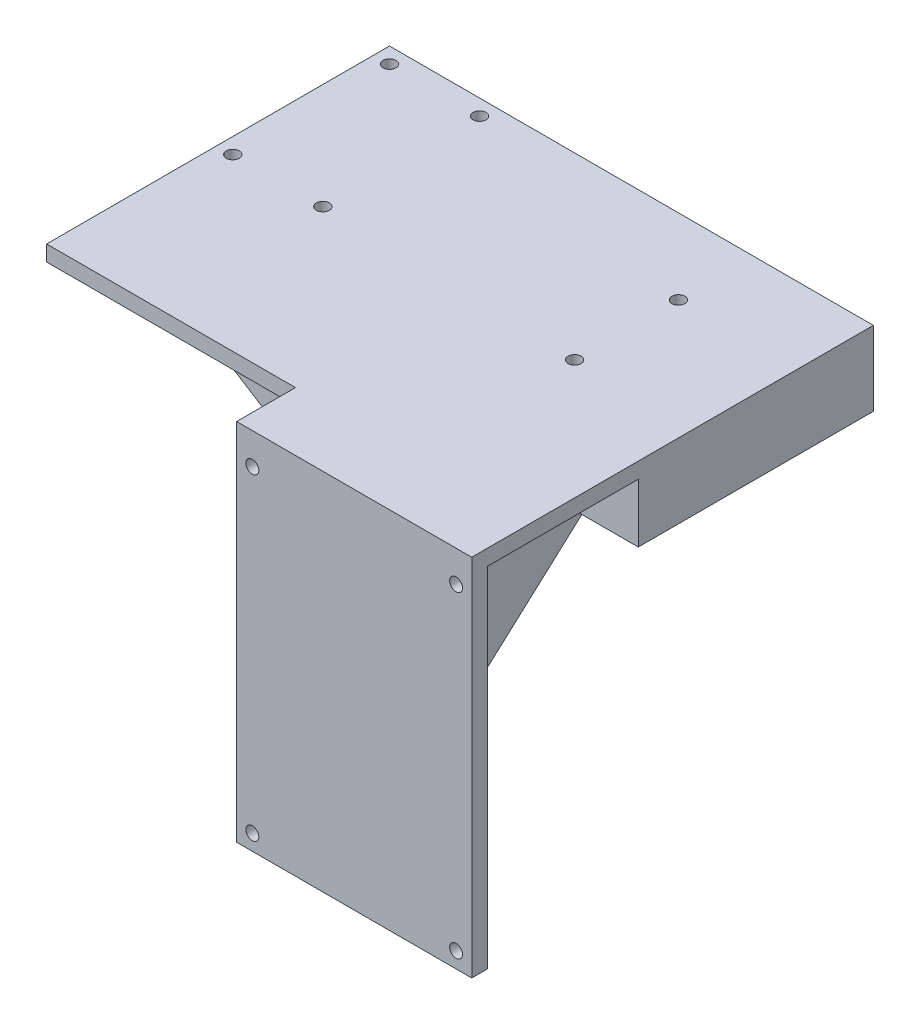
ISO-10303-21;
HEADER;
FILE_DESCRIPTION(('STEP AP214'),'2;1');
FILE_NAME('part.step','',(''),(''),'','','');
FILE_SCHEMA(('AUTOMOTIVE_DESIGN { 1 0 10303 214 1 1 1 1 }'));
ENDSEC;
DATA;
#1=APPLICATION_CONTEXT('core data for automotive mechanical design processes');
#2=APPLICATION_PROTOCOL_DEFINITION('international standard','automotive_design',2000,#1);
#3=PRODUCT_CONTEXT('',#1,'mechanical');
#4=PRODUCT('Part','Part','',(#3));
#5=PRODUCT_RELATED_PRODUCT_CATEGORY('part','',(#4));
#6=PRODUCT_DEFINITION_FORMATION('','',#4);
#7=PRODUCT_DEFINITION_CONTEXT('part definition',#1,'design');
#8=PRODUCT_DEFINITION('design','',#6,#7);
#9=PRODUCT_DEFINITION_SHAPE('','',#8);
#10=(LENGTH_UNIT() NAMED_UNIT(*) SI_UNIT(.MILLI.,.METRE.));
#11=(NAMED_UNIT(*) PLANE_ANGLE_UNIT() SI_UNIT($,.RADIAN.));
#12=(NAMED_UNIT(*) SI_UNIT($,.STERADIAN.) SOLID_ANGLE_UNIT());
#13=UNCERTAINTY_MEASURE_WITH_UNIT(LENGTH_MEASURE(1.E-05),#10,'distance_accuracy_value','');
#14=(GEOMETRIC_REPRESENTATION_CONTEXT(3) GLOBAL_UNCERTAINTY_ASSIGNED_CONTEXT((#13)) GLOBAL_UNIT_ASSIGNED_CONTEXT((#10,
#11,#12)) REPRESENTATION_CONTEXT('',''));
#15=CARTESIAN_POINT('',(0.,0.,0.));
#16=DIRECTION('',(0.,0.,1.));
#17=DIRECTION('',(1.,0.,0.));
#18=AXIS2_PLACEMENT_3D('',#15,#16,#17);
#19=CARTESIAN_POINT('',(60.,-4.,-15.));
#20=DIRECTION('',(0.,1.,0.));
#21=DIRECTION('',(0.,0.,1.));
#22=AXIS2_PLACEMENT_3D('',#19,#20,#21);
#23=PLANE('',#22);
#24=CARTESIAN_POINT('',(29.5,-4.,-83.25));
#25=DIRECTION('',(0.,1.,0.));
#26=DIRECTION('',(0.,0.,1.));
#27=AXIS2_PLACEMENT_3D('',#24,#25,#26);
#28=CIRCLE('',#27,1.65);
#29=CARTESIAN_POINT('',(29.5,-4.,-81.6));
#30=VERTEX_POINT('',#29);
#31=EDGE_CURVE('E244',#30,#30,#28,.T.);
#32=ORIENTED_EDGE('',*,*,#31,.T.);
#33=EDGE_LOOP('',(#32));
#34=FACE_BOUND('',#33,.T.);
#35=CARTESIAN_POINT('',(29.5,-4.,-56.75));
#36=DIRECTION('',(0.,1.,0.));
#37=DIRECTION('',(0.,0.,1.));
#38=AXIS2_PLACEMENT_3D('',#35,#36,#37);
#39=CIRCLE('',#38,1.65);
#40=CARTESIAN_POINT('',(29.5,-4.,-55.1));
#41=VERTEX_POINT('',#40);
#42=EDGE_CURVE('E36',#41,#41,#39,.T.);
#43=ORIENTED_EDGE('',*,*,#42,.T.);
#44=EDGE_LOOP('',(#43));
#45=FACE_BOUND('',#44,.T.);
#46=DIRECTION('',(-1.,0.,0.));
#47=VECTOR('',#46,1.);
#48=CARTESIAN_POINT('',(60.,-4.,-42.5));
#49=LINE('',#48,#47);
#50=CARTESIAN_POINT('',(60.,-4.,-42.5));
#51=VERTEX_POINT('',#50);
#52=CARTESIAN_POINT('',(35.,-4.,-42.5));
#53=VERTEX_POINT('',#52);
#54=EDGE_CURVE('E598',#51,#53,#49,.T.);
#55=ORIENTED_EDGE('',*,*,#54,.F.);
#56=DIRECTION('',(0.,0.,1.));
#57=VECTOR('',#56,1.);
#58=CARTESIAN_POINT('',(60.,-4.,-15.));
#59=LINE('',#58,#57);
#60=CARTESIAN_POINT('',(60.,-4.,-4.));
#61=VERTEX_POINT('',#60);
#62=EDGE_CURVE('E177',#51,#61,#59,.T.);
#63=ORIENTED_EDGE('',*,*,#62,.T.);
#64=DIRECTION('',(-1.,0.,0.));
#65=VECTOR('',#64,1.);
#66=CARTESIAN_POINT('',(60.,-4.,-4.));
#67=LINE('',#66,#65);
#68=CARTESIAN_POINT('',(25.,-4.,-4.));
#69=VERTEX_POINT('',#68);
#70=EDGE_CURVE('E285',#61,#69,#67,.T.);
#71=ORIENTED_EDGE('',*,*,#70,.T.);
#72=DIRECTION('',(0.,0.,1.));
#73=VECTOR('',#72,1.);
#74=CARTESIAN_POINT('',(25.,-4.,-4.));
#75=LINE('',#74,#73);
#76=CARTESIAN_POINT('',(25.,-4.,-102.5));
#77=VERTEX_POINT('',#76);
#78=EDGE_CURVE('E236',#77,#69,#75,.T.);
#79=ORIENTED_EDGE('',*,*,#78,.F.);
#80=DIRECTION('',(-1.,0.,0.));
#81=VECTOR('',#80,1.);
#82=CARTESIAN_POINT('',(60.,-4.,-102.5));
#83=LINE('',#82,#81);
#84=CARTESIAN_POINT('',(35.,-4.,-102.5));
#85=VERTEX_POINT('',#84);
#86=EDGE_CURVE('E264',#85,#77,#83,.T.);
#87=ORIENTED_EDGE('',*,*,#86,.F.);
#88=DIRECTION('',(0.,0.,-1.));
#89=VECTOR('',#88,1.);
#90=CARTESIAN_POINT('',(35.,-4.,-102.5));
#91=LINE('',#90,#89);
#92=EDGE_CURVE('E171',#53,#85,#91,.T.);
#93=ORIENTED_EDGE('',*,*,#92,.F.);
#94=EDGE_LOOP('',(#55,#63,#71,#79,#87,#93));
#95=FACE_BOUND('',#94,.T.);
#96=ADVANCED_FACE('F32',(#34,#45,#95),#23,.F.);
#97=CARTESIAN_POINT('',(-59.5,-4.,-98.5));
#98=DIRECTION('',(0.,1.,0.));
#99=DIRECTION('',(0.,0.,1.));
#100=AXIS2_PLACEMENT_3D('',#97,#98,#99);
#101=CIRCLE('',#100,1.65);
#102=CARTESIAN_POINT('',(-59.5,-4.,-96.85));
#103=VERTEX_POINT('',#102);
#104=EDGE_CURVE('E258',#103,#103,#101,.T.);
#105=ORIENTED_EDGE('',*,*,#104,.T.);
#106=EDGE_LOOP('',(#105));
#107=FACE_BOUND('',#106,.T.);
#108=CARTESIAN_POINT('',(-36.5,-4.,-58.5));
#109=DIRECTION('',(0.,1.,0.));
#110=DIRECTION('',(0.,0.,1.));
#111=AXIS2_PLACEMENT_3D('',#108,#109,#110);
#112=CIRCLE('',#111,1.65);
#113=CARTESIAN_POINT('',(-36.5,-4.,-56.85));
#114=VERTEX_POINT('',#113);
#115=EDGE_CURVE('E248',#114,#114,#112,.T.);
#116=ORIENTED_EDGE('',*,*,#115,.T.);
#117=EDGE_LOOP('',(#116));
#118=FACE_BOUND('',#117,.T.);
#119=CARTESIAN_POINT('',(-59.5,-4.,-58.5));
#120=DIRECTION('',(0.,1.,0.));
#121=DIRECTION('',(0.,0.,1.));
#122=AXIS2_PLACEMENT_3D('',#119,#120,#121);
#123=CIRCLE('',#122,1.65);
#124=CARTESIAN_POINT('',(-59.5,-4.,-56.85));
#125=VERTEX_POINT('',#124);
#126=EDGE_CURVE('E335',#125,#125,#123,.T.);
#127=ORIENTED_EDGE('',*,*,#126,.T.);
#128=EDGE_LOOP('',(#127));
#129=FACE_BOUND('',#128,.T.);
#130=CARTESIAN_POINT('',(-36.5,-4.,-98.5));
#131=DIRECTION('',(0.,1.,0.));
#132=DIRECTION('',(0.,0.,1.));
#133=AXIS2_PLACEMENT_3D('',#130,#131,#132);
#134=CIRCLE('',#133,1.65);
#135=CARTESIAN_POINT('',(-36.5,-4.,-96.85));
#136=VERTEX_POINT('',#135);
#137=EDGE_CURVE('E259',#136,#136,#134,.T.);
#138=ORIENTED_EDGE('',*,*,#137,.T.);
#139=EDGE_LOOP('',(#138));
#140=FACE_BOUND('',#139,.T.);
#141=DIRECTION('',(1.,0.,0.));
#142=VECTOR('',#141,1.);
#143=CARTESIAN_POINT('',(-63.5,-4.,-50.5));
#144=LINE('',#143,#142);
#145=CARTESIAN_POINT('',(-63.5,-4.,-50.5));
#146=VERTEX_POINT('',#145);
#147=CARTESIAN_POINT('',(8.00000000000001,-4.,-50.5));
#148=VERTEX_POINT('',#147);
#149=EDGE_CURVE('E188',#146,#148,#144,.T.);
#150=ORIENTED_EDGE('',*,*,#149,.F.);
#151=DIRECTION('',(0.,0.,1.));
#152=VECTOR('',#151,1.);
#153=CARTESIAN_POINT('',(-63.5,-4.,-102.5));
#154=LINE('',#153,#152);
#155=CARTESIAN_POINT('',(-63.5,-4.,-102.5));
#156=VERTEX_POINT('',#155);
#157=EDGE_CURVE('E282',#156,#146,#154,.T.);
#158=ORIENTED_EDGE('',*,*,#157,.F.);
#159=CARTESIAN_POINT('',(8.,-4.,-102.5));
#160=VERTEX_POINT('',#159);
#161=EDGE_CURVE('E262',#160,#156,#83,.T.);
#162=ORIENTED_EDGE('',*,*,#161,.F.);
#163=DIRECTION('',(0.,0.,-1.));
#164=VECTOR('',#163,1.);
#165=CARTESIAN_POINT('',(8.,-4.,-102.5));
#166=LINE('',#165,#164);
#167=EDGE_CURVE('E215',#148,#160,#166,.T.);
#168=ORIENTED_EDGE('',*,*,#167,.F.);
#169=EDGE_LOOP('',(#150,#158,#162,#168));
#170=FACE_BOUND('',#169,.T.);
#171=ADVANCED_FACE('F361',(#107,#118,#129,#140,#170),#23,.F.);
#172=DIRECTION('',(-1.,0.,0.));
#173=VECTOR('',#172,1.);
#174=CARTESIAN_POINT('',(-63.5,-4.,-33.5));
#175=LINE('',#174,#173);
#176=CARTESIAN_POINT('',(8.,-4.,-33.5));
#177=VERTEX_POINT('',#176);
#178=CARTESIAN_POINT('',(-63.5,-4.,-33.5));
#179=VERTEX_POINT('',#178);
#180=EDGE_CURVE('E192',#177,#179,#175,.T.);
#181=ORIENTED_EDGE('',*,*,#180,.F.);
#182=CARTESIAN_POINT('',(8.,-4.,-4.00000000000002));
#183=VERTEX_POINT('',#182);
#184=EDGE_CURVE('E217',#183,#177,#166,.T.);
#185=ORIENTED_EDGE('',*,*,#184,.F.);
#186=DIRECTION('',(-1.,0.,0.));
#187=VECTOR('',#186,1.);
#188=CARTESIAN_POINT('',(8.,-4.,-4.00000000000002));
#189=LINE('',#188,#187);
#190=CARTESIAN_POINT('',(0.,-4.,-4.00000000000002));
#191=VERTEX_POINT('',#190);
#192=EDGE_CURVE('E224',#183,#191,#189,.T.);
#193=ORIENTED_EDGE('',*,*,#192,.T.);
#194=DIRECTION('',(0.,0.,-1.));
#195=VECTOR('',#194,1.);
#196=CARTESIAN_POINT('',(0.,-4.,-102.5));
#197=LINE('',#196,#195);
#198=CARTESIAN_POINT('',(0.,-4.,-15.));
#199=VERTEX_POINT('',#198);
#200=EDGE_CURVE('E216',#191,#199,#197,.T.);
#201=ORIENTED_EDGE('',*,*,#200,.T.);
#202=DIRECTION('',(-1.,0.,0.));
#203=VECTOR('',#202,1.);
#204=CARTESIAN_POINT('',(60.,-4.,-15.));
#205=LINE('',#204,#203);
#206=CARTESIAN_POINT('',(-63.5,-4.,-15.));
#207=VERTEX_POINT('',#206);
#208=EDGE_CURVE('E272',#199,#207,#205,.T.);
#209=ORIENTED_EDGE('',*,*,#208,.T.);
#210=EDGE_CURVE('E281',#179,#207,#154,.T.);
#211=ORIENTED_EDGE('',*,*,#210,.F.);
#212=EDGE_LOOP('',(#181,#185,#193,#201,#209,#211));
#213=FACE_BOUND('',#212,.T.);
#214=ADVANCED_FACE('F363',(#213),#23,.F.);
#215=CARTESIAN_POINT('',(8.,0.,0.));
#216=DIRECTION('',(-1.,0.,0.));
#217=DIRECTION('',(0.,0.,1.));
#218=AXIS2_PLACEMENT_3D('',#215,#216,#217);
#219=PLANE('',#218);
#220=DIRECTION('',(0.,1.,0.));
#221=VECTOR('',#220,1.);
#222=CARTESIAN_POINT('',(8.,-49.,-33.5));
#223=LINE('',#222,#221);
#224=CARTESIAN_POINT('',(8.,-49.,-33.5));
#225=VERTEX_POINT('',#224);
#226=EDGE_CURVE('E191',#225,#177,#223,.T.);
#227=ORIENTED_EDGE('',*,*,#226,.F.);
#228=DIRECTION('',(0.,0.,1.));
#229=VECTOR('',#228,1.);
#230=CARTESIAN_POINT('',(8.00000000000001,-49.,-50.5));
#231=LINE('',#230,#229);
#232=CARTESIAN_POINT('',(8.,-49.,-50.5));
#233=VERTEX_POINT('',#232);
#234=EDGE_CURVE('E189',#233,#225,#231,.T.);
#235=ORIENTED_EDGE('',*,*,#234,.F.);
#236=DIRECTION('',(0.,1.,0.));
#237=VECTOR('',#236,1.);
#238=CARTESIAN_POINT('',(8.00000000000001,-49.,-50.5));
#239=LINE('',#238,#237);
#240=EDGE_CURVE('E197',#233,#148,#239,.T.);
#241=ORIENTED_EDGE('',*,*,#240,.T.);
#242=ORIENTED_EDGE('',*,*,#167,.T.);
#243=DIRECTION('',(0.,0.670420067759688,-0.741981760385722));
#244=VECTOR('',#243,1.);
#245=CARTESIAN_POINT('',(8.,-4.,-102.5));
#246=LINE('',#245,#244);
#247=CARTESIAN_POINT('',(8.,-93.,-4.));
#248=VERTEX_POINT('',#247);
#249=EDGE_CURVE('E200',#248,#160,#246,.T.);
#250=ORIENTED_EDGE('',*,*,#249,.F.);
#251=DIRECTION('',(0.,1.,0.));
#252=VECTOR('',#251,1.);
#253=CARTESIAN_POINT('',(8.,-4.,-4.00000000000002));
#254=LINE('',#253,#252);
#255=EDGE_CURVE('E212',#248,#183,#254,.T.);
#256=ORIENTED_EDGE('',*,*,#255,.T.);
#257=ORIENTED_EDGE('',*,*,#184,.T.);
#258=EDGE_LOOP('',(#227,#235,#241,#242,#250,#256,#257));
#259=FACE_BOUND('',#258,.T.);
#260=ADVANCED_FACE('F371',(#259),#219,.T.);
#261=CARTESIAN_POINT('',(0.,0.,-4.));
#262=DIRECTION('',(0.,0.,1.));
#263=DIRECTION('',(1.,0.,0.));
#264=AXIS2_PLACEMENT_3D('',#261,#262,#263);
#265=PLANE('',#264);
#266=CARTESIAN_POINT('',(56.,-8.00000000000001,-4.));
#267=DIRECTION('',(0.,0.,1.));
#268=DIRECTION('',(1.,0.,0.));
#269=AXIS2_PLACEMENT_3D('',#266,#267,#268);
#270=CIRCLE('',#269,1.65);
#271=CARTESIAN_POINT('',(57.65,-8.00000000000001,-4.));
#272=VERTEX_POINT('',#271);
#273=EDGE_CURVE('E293',#272,#272,#270,.T.);
#274=ORIENTED_EDGE('',*,*,#273,.T.);
#275=EDGE_LOOP('',(#274));
#276=FACE_BOUND('',#275,.T.);
#277=CARTESIAN_POINT('',(56.,-89.,-4.));
#278=DIRECTION('',(0.,0.,1.));
#279=DIRECTION('',(1.,0.,0.));
#280=AXIS2_PLACEMENT_3D('',#277,#278,#279);
#281=CIRCLE('',#280,1.65);
#282=CARTESIAN_POINT('',(57.65,-89.,-4.));
#283=VERTEX_POINT('',#282);
#284=EDGE_CURVE('E303',#283,#283,#281,.T.);
#285=ORIENTED_EDGE('',*,*,#284,.T.);
#286=EDGE_LOOP('',(#285));
#287=FACE_BOUND('',#286,.T.);
#288=DIRECTION('',(0.,-1.,0.));
#289=VECTOR('',#288,1.);
#290=CARTESIAN_POINT('',(25.,-93.,-4.));
#291=LINE('',#290,#289);
#292=CARTESIAN_POINT('',(25.,-93.,-4.));
#293=VERTEX_POINT('',#292);
#294=EDGE_CURVE('E233',#69,#293,#291,.T.);
#295=ORIENTED_EDGE('',*,*,#294,.F.);
#296=ORIENTED_EDGE('',*,*,#70,.F.);
#297=DIRECTION('',(0.,1.,0.));
#298=VECTOR('',#297,1.);
#299=CARTESIAN_POINT('',(60.,0.,-4.));
#300=LINE('',#299,#298);
#301=CARTESIAN_POINT('',(60.,-93.,-4.));
#302=VERTEX_POINT('',#301);
#303=EDGE_CURVE('E313',#302,#61,#300,.T.);
#304=ORIENTED_EDGE('',*,*,#303,.F.);
#305=DIRECTION('',(1.,0.,0.));
#306=VECTOR('',#305,1.);
#307=CARTESIAN_POINT('',(0.,-93.,-4.));
#308=LINE('',#307,#306);
#309=EDGE_CURVE('E311',#293,#302,#308,.T.);
#310=ORIENTED_EDGE('',*,*,#309,.F.);
#311=EDGE_LOOP('',(#295,#296,#304,#310));
#312=FACE_BOUND('',#311,.T.);
#313=ADVANCED_FACE('F376',(#276,#287,#312),#265,.F.);
#314=CARTESIAN_POINT('',(0.,0.,-4.));
#315=DIRECTION('',(-1.,0.,0.));
#316=DIRECTION('',(0.,0.,1.));
#317=AXIS2_PLACEMENT_3D('',#314,#315,#316);
#318=PLANE('',#317);
#319=ORIENTED_EDGE('',*,*,#200,.F.);
#320=DIRECTION('',(0.,1.,0.));
#321=VECTOR('',#320,1.);
#322=CARTESIAN_POINT('',(0.,-4.,-4.00000000000002));
#323=LINE('',#322,#321);
#324=CARTESIAN_POINT('',(0.,-93.,-4.));
#325=VERTEX_POINT('',#324);
#326=EDGE_CURVE('E211',#325,#191,#323,.T.);
#327=ORIENTED_EDGE('',*,*,#326,.F.);
#328=DIRECTION('',(0.,0.,1.));
#329=VECTOR('',#328,1.);
#330=CARTESIAN_POINT('',(0.,-93.,-4.));
#331=LINE('',#330,#329);
#332=CARTESIAN_POINT('',(0.,-93.,0.));
#333=VERTEX_POINT('',#332);
#334=EDGE_CURVE('E316',#325,#333,#331,.T.);
#335=ORIENTED_EDGE('',*,*,#334,.T.);
#336=DIRECTION('',(0.,-1.,0.));
#337=VECTOR('',#336,1.);
#338=CARTESIAN_POINT('',(0.,0.,0.));
#339=LINE('',#338,#337);
#340=CARTESIAN_POINT('',(0.,0.,0.));
#341=VERTEX_POINT('',#340);
#342=EDGE_CURVE('E310',#341,#333,#339,.T.);
#343=ORIENTED_EDGE('',*,*,#342,.F.);
#344=DIRECTION('',(0.,0.,1.));
#345=VECTOR('',#344,1.);
#346=CARTESIAN_POINT('',(0.,0.,-4.));
#347=LINE('',#346,#345);
#348=CARTESIAN_POINT('',(0.,0.,-15.));
#349=VERTEX_POINT('',#348);
#350=EDGE_CURVE('E11',#349,#341,#347,.T.);
#351=ORIENTED_EDGE('',*,*,#350,.F.);
#352=DIRECTION('',(0.,1.,0.));
#353=VECTOR('',#352,1.);
#354=CARTESIAN_POINT('',(0.,0.,-15.));
#355=LINE('',#354,#353);
#356=EDGE_CURVE('E286',#199,#349,#355,.T.);
#357=ORIENTED_EDGE('',*,*,#356,.F.);
#358=EDGE_LOOP('',(#319,#327,#335,#343,#351,#357));
#359=FACE_BOUND('',#358,.T.);
#360=ADVANCED_FACE('F34',(#359),#318,.T.);
#361=CARTESIAN_POINT('',(0.,0.,-4.));
#362=DIRECTION('',(0.,1.,0.));
#363=DIRECTION('',(0.,0.,1.));
#364=AXIS2_PLACEMENT_3D('',#361,#362,#363);
#365=PLANE('',#364);
#366=CARTESIAN_POINT('',(29.5,0.,-56.75));
#367=DIRECTION('',(0.,1.,0.));
#368=DIRECTION('',(0.,0.,1.));
#369=AXIS2_PLACEMENT_3D('',#366,#367,#368);
#370=CIRCLE('',#369,1.65);
#371=CARTESIAN_POINT('',(29.5,0.,-55.1));
#372=VERTEX_POINT('',#371);
#373=EDGE_CURVE('E238',#372,#372,#370,.T.);
#374=ORIENTED_EDGE('',*,*,#373,.F.);
#375=EDGE_LOOP('',(#374));
#376=FACE_BOUND('',#375,.T.);
#377=CARTESIAN_POINT('',(29.5,0.,-83.25));
#378=DIRECTION('',(0.,1.,0.));
#379=DIRECTION('',(0.,0.,1.));
#380=AXIS2_PLACEMENT_3D('',#377,#378,#379);
#381=CIRCLE('',#380,1.65);
#382=CARTESIAN_POINT('',(29.5,0.,-81.6));
#383=VERTEX_POINT('',#382);
#384=EDGE_CURVE('E241',#383,#383,#381,.T.);
#385=ORIENTED_EDGE('',*,*,#384,.F.);
#386=EDGE_LOOP('',(#385));
#387=FACE_BOUND('',#386,.T.);
#388=CARTESIAN_POINT('',(-36.5,0.,-98.5));
#389=DIRECTION('',(0.,1.,0.));
#390=DIRECTION('',(0.,0.,1.));
#391=AXIS2_PLACEMENT_3D('',#388,#389,#390);
#392=CIRCLE('',#391,1.65);
#393=CARTESIAN_POINT('',(-36.5,0.,-96.85));
#394=VERTEX_POINT('',#393);
#395=EDGE_CURVE('E245',#394,#394,#392,.T.);
#396=ORIENTED_EDGE('',*,*,#395,.F.);
#397=EDGE_LOOP('',(#396));
#398=FACE_BOUND('',#397,.T.);
#399=CARTESIAN_POINT('',(-59.5,0.,-58.5));
#400=DIRECTION('',(0.,1.,0.));
#401=DIRECTION('',(0.,0.,1.));
#402=AXIS2_PLACEMENT_3D('',#399,#400,#401);
#403=CIRCLE('',#402,1.65);
#404=CARTESIAN_POINT('',(-59.5,0.,-56.85));
#405=VERTEX_POINT('',#404);
#406=EDGE_CURVE('E249',#405,#405,#403,.T.);
#407=ORIENTED_EDGE('',*,*,#406,.F.);
#408=EDGE_LOOP('',(#407));
#409=FACE_BOUND('',#408,.T.);
#410=CARTESIAN_POINT('',(-36.5,0.,-58.5));
#411=DIRECTION('',(0.,1.,0.));
#412=DIRECTION('',(0.,0.,1.));
#413=AXIS2_PLACEMENT_3D('',#410,#411,#412);
#414=CIRCLE('',#413,1.65);
#415=CARTESIAN_POINT('',(-36.5,0.,-56.85));
#416=VERTEX_POINT('',#415);
#417=EDGE_CURVE('E252',#416,#416,#414,.T.);
#418=ORIENTED_EDGE('',*,*,#417,.F.);
#419=EDGE_LOOP('',(#418));
#420=FACE_BOUND('',#419,.T.);
#421=CARTESIAN_POINT('',(-59.5,0.,-98.5));
#422=DIRECTION('',(0.,1.,0.));
#423=DIRECTION('',(0.,0.,1.));
#424=AXIS2_PLACEMENT_3D('',#421,#422,#423);
#425=CIRCLE('',#424,1.65);
#426=CARTESIAN_POINT('',(-59.5,0.,-96.85));
#427=VERTEX_POINT('',#426);
#428=EDGE_CURVE('E255',#427,#427,#425,.T.);
#429=ORIENTED_EDGE('',*,*,#428,.F.);
#430=EDGE_LOOP('',(#429));
#431=FACE_BOUND('',#430,.T.);
#432=DIRECTION('',(-1.,0.,0.));
#433=VECTOR('',#432,1.);
#434=CARTESIAN_POINT('',(0.,0.,0.));
#435=LINE('',#434,#433);
#436=CARTESIAN_POINT('',(60.,0.,0.));
#437=VERTEX_POINT('',#436);
#438=EDGE_CURVE('E314',#437,#341,#435,.T.);
#439=ORIENTED_EDGE('',*,*,#438,.F.);
#440=DIRECTION('',(0.,0.,1.));
#441=VECTOR('',#440,1.);
#442=CARTESIAN_POINT('',(60.,0.,-4.));
#443=LINE('',#442,#441);
#444=CARTESIAN_POINT('',(60.,0.,-102.5));
#445=VERTEX_POINT('',#444);
#446=EDGE_CURVE('E41',#445,#437,#443,.T.);
#447=ORIENTED_EDGE('',*,*,#446,.F.);
#448=DIRECTION('',(1.,0.,0.));
#449=VECTOR('',#448,1.);
#450=CARTESIAN_POINT('',(60.,0.,-102.5));
#451=LINE('',#450,#449);
#452=CARTESIAN_POINT('',(-63.5,0.,-102.5));
#453=VERTEX_POINT('',#452);
#454=EDGE_CURVE('E268',#453,#445,#451,.T.);
#455=ORIENTED_EDGE('',*,*,#454,.F.);
#456=DIRECTION('',(0.,0.,1.));
#457=VECTOR('',#456,1.);
#458=CARTESIAN_POINT('',(-63.5,0.,-102.5));
#459=LINE('',#458,#457);
#460=CARTESIAN_POINT('',(-63.5,0.,-15.));
#461=VERTEX_POINT('',#460);
#462=EDGE_CURVE('E271',#453,#461,#459,.T.);
#463=ORIENTED_EDGE('',*,*,#462,.T.);
#464=DIRECTION('',(1.,0.,0.));
#465=VECTOR('',#464,1.);
#466=CARTESIAN_POINT('',(60.,0.,-15.));
#467=LINE('',#466,#465);
#468=EDGE_CURVE('E263',#461,#349,#467,.T.);
#469=ORIENTED_EDGE('',*,*,#468,.T.);
#470=ORIENTED_EDGE('',*,*,#350,.T.);
#471=EDGE_LOOP('',(#439,#447,#455,#463,#469,#470));
#472=FACE_BOUND('',#471,.T.);
#473=ADVANCED_FACE('F414',(#376,#387,#398,#409,#420,#431,#472),#365,.T.);
#474=CARTESIAN_POINT('',(60.,0.,-4.));
#475=DIRECTION('',(1.,0.,0.));
#476=DIRECTION('',(0.,1.,0.));
#477=AXIS2_PLACEMENT_3D('',#474,#475,#476);
#478=PLANE('',#477);
#479=DIRECTION('',(0.,1.,0.));
#480=VECTOR('',#479,1.);
#481=CARTESIAN_POINT('',(60.,0.,0.));
#482=LINE('',#481,#480);
#483=CARTESIAN_POINT('',(60.,-93.,0.));
#484=VERTEX_POINT('',#483);
#485=EDGE_CURVE('E322',#484,#437,#482,.T.);
#486=ORIENTED_EDGE('',*,*,#485,.F.);
#487=DIRECTION('',(0.,0.,1.));
#488=VECTOR('',#487,1.);
#489=CARTESIAN_POINT('',(60.,-93.,-4.));
#490=LINE('',#489,#488);
#491=EDGE_CURVE('E328',#302,#484,#490,.T.);
#492=ORIENTED_EDGE('',*,*,#491,.F.);
#493=ORIENTED_EDGE('',*,*,#303,.T.);
#494=ORIENTED_EDGE('',*,*,#62,.F.);
#495=DIRECTION('',(0.,1.,0.));
#496=VECTOR('',#495,1.);
#497=CARTESIAN_POINT('',(60.,-19.,-42.5));
#498=LINE('',#497,#496);
#499=CARTESIAN_POINT('',(60.,-19.,-42.5));
#500=VERTEX_POINT('',#499);
#501=EDGE_CURVE('E156',#500,#51,#498,.T.);
#502=ORIENTED_EDGE('',*,*,#501,.F.);
#503=DIRECTION('',(0.,0.,1.));
#504=VECTOR('',#503,1.);
#505=CARTESIAN_POINT('',(60.,-19.,-102.5));
#506=LINE('',#505,#504);
#507=CARTESIAN_POINT('',(60.,-19.,-102.5));
#508=VERTEX_POINT('',#507);
#509=EDGE_CURVE('E163',#508,#500,#506,.T.);
#510=ORIENTED_EDGE('',*,*,#509,.F.);
#511=DIRECTION('',(0.,-1.,0.));
#512=VECTOR('',#511,1.);
#513=CARTESIAN_POINT('',(60.,-4.,-102.5));
#514=LINE('',#513,#512);
#515=EDGE_CURVE('E260',#445,#508,#514,.T.);
#516=ORIENTED_EDGE('',*,*,#515,.F.);
#517=ORIENTED_EDGE('',*,*,#446,.T.);
#518=EDGE_LOOP('',(#486,#492,#493,#494,#502,#510,#516,#517));
#519=FACE_BOUND('',#518,.T.);
#520=ADVANCED_FACE('F175',(#519),#478,.T.);
#521=CARTESIAN_POINT('',(0.,-93.,-4.));
#522=DIRECTION('',(0.,-1.,0.));
#523=DIRECTION('',(0.,0.,-1.));
#524=AXIS2_PLACEMENT_3D('',#521,#522,#523);
#525=PLANE('',#524);
#526=DIRECTION('',(-1.,0.,0.));
#527=VECTOR('',#526,1.);
#528=CARTESIAN_POINT('',(28.,-93.,-4.));
#529=LINE('',#528,#527);
#530=EDGE_CURVE('E204',#293,#248,#529,.T.);
#531=ORIENTED_EDGE('',*,*,#530,.F.);
#532=ORIENTED_EDGE('',*,*,#309,.T.);
#533=ORIENTED_EDGE('',*,*,#491,.T.);
#534=DIRECTION('',(1.,0.,0.));
#535=VECTOR('',#534,1.);
#536=CARTESIAN_POINT('',(0.,-93.,0.));
#537=LINE('',#536,#535);
#538=EDGE_CURVE('E319',#333,#484,#537,.T.);
#539=ORIENTED_EDGE('',*,*,#538,.F.);
#540=ORIENTED_EDGE('',*,*,#334,.F.);
#541=DIRECTION('',(-1.,0.,0.));
#542=VECTOR('',#541,1.);
#543=CARTESIAN_POINT('',(8.,-93.,-4.));
#544=LINE('',#543,#542);
#545=EDGE_CURVE('E220',#248,#325,#544,.T.);
#546=ORIENTED_EDGE('',*,*,#545,.F.);
#547=EDGE_LOOP('',(#531,#532,#533,#539,#540,#546));
#548=FACE_BOUND('',#547,.T.);
#549=ADVANCED_FACE('F395',(#548),#525,.T.);
#550=CARTESIAN_POINT('',(0.,0.,0.));
#551=DIRECTION('',(0.,0.,1.));
#552=DIRECTION('',(1.,0.,0.));
#553=AXIS2_PLACEMENT_3D('',#550,#551,#552);
#554=PLANE('',#553);
#555=CARTESIAN_POINT('',(56.,-8.00000000000001,0.));
#556=DIRECTION('',(0.,0.,1.));
#557=DIRECTION('',(1.,0.,0.));
#558=AXIS2_PLACEMENT_3D('',#555,#556,#557);
#559=CIRCLE('',#558,1.65);
#560=CARTESIAN_POINT('',(57.65,-8.00000000000001,0.));
#561=VERTEX_POINT('',#560);
#562=EDGE_CURVE('E297',#561,#561,#559,.T.);
#563=ORIENTED_EDGE('',*,*,#562,.F.);
#564=EDGE_LOOP('',(#563));
#565=FACE_BOUND('',#564,.T.);
#566=CARTESIAN_POINT('',(4.,-89.,0.));
#567=DIRECTION('',(0.,0.,1.));
#568=DIRECTION('',(1.,0.,0.));
#569=AXIS2_PLACEMENT_3D('',#566,#567,#568);
#570=CIRCLE('',#569,1.65);
#571=CARTESIAN_POINT('',(5.65,-89.,0.));
#572=VERTEX_POINT('',#571);
#573=EDGE_CURVE('E300',#572,#572,#570,.T.);
#574=ORIENTED_EDGE('',*,*,#573,.F.);
#575=EDGE_LOOP('',(#574));
#576=FACE_BOUND('',#575,.T.);
#577=CARTESIAN_POINT('',(56.,-89.,0.));
#578=DIRECTION('',(0.,0.,1.));
#579=DIRECTION('',(1.,0.,0.));
#580=AXIS2_PLACEMENT_3D('',#577,#578,#579);
#581=CIRCLE('',#580,1.65);
#582=CARTESIAN_POINT('',(57.65,-89.,0.));
#583=VERTEX_POINT('',#582);
#584=EDGE_CURVE('E292',#583,#583,#581,.T.);
#585=ORIENTED_EDGE('',*,*,#584,.F.);
#586=EDGE_LOOP('',(#585));
#587=FACE_BOUND('',#586,.T.);
#588=CARTESIAN_POINT('',(4.,-8.,0.));
#589=DIRECTION('',(0.,0.,1.));
#590=DIRECTION('',(1.,0.,0.));
#591=AXIS2_PLACEMENT_3D('',#588,#589,#590);
#592=CIRCLE('',#591,1.65);
#593=CARTESIAN_POINT('',(5.65,-8.,0.));
#594=VERTEX_POINT('',#593);
#595=EDGE_CURVE('E296',#594,#594,#592,.T.);
#596=ORIENTED_EDGE('',*,*,#595,.F.);
#597=EDGE_LOOP('',(#596));
#598=FACE_BOUND('',#597,.T.);
#599=ORIENTED_EDGE('',*,*,#342,.T.);
#600=ORIENTED_EDGE('',*,*,#538,.T.);
#601=ORIENTED_EDGE('',*,*,#485,.T.);
#602=ORIENTED_EDGE('',*,*,#438,.T.);
#603=EDGE_LOOP('',(#599,#600,#601,#602));
#604=FACE_BOUND('',#603,.T.);
#605=ADVANCED_FACE('F418',(#565,#576,#587,#598,#604),#554,.T.);
#606=CARTESIAN_POINT('',(4.,-8.,-4.));
#607=DIRECTION('',(0.,0.,1.));
#608=DIRECTION('',(1.,0.,0.));
#609=AXIS2_PLACEMENT_3D('',#606,#607,#608);
#610=CYLINDRICAL_SURFACE('',#609,1.65);
#611=CARTESIAN_POINT('',(4.,-8.,-4.00000000000002));
#612=DIRECTION('',(0.,0.,1.));
#613=DIRECTION('',(0.,-1.,0.));
#614=AXIS2_PLACEMENT_3D('',#611,#612,#613);
#615=CIRCLE('',#614,1.65);
#616=CARTESIAN_POINT('',(4.,-9.65,-4.00000000000002));
#617=VERTEX_POINT('',#616);
#618=EDGE_CURVE('E230',#617,#617,#615,.F.);
#619=ORIENTED_EDGE('',*,*,#618,.T.);
#620=EDGE_LOOP('',(#619));
#621=FACE_BOUND('',#620,.T.);
#622=ORIENTED_EDGE('',*,*,#595,.T.);
#623=EDGE_LOOP('',(#622));
#624=FACE_BOUND('',#623,.T.);
#625=ADVANCED_FACE('F420',(#621,#624),#610,.F.);
#626=CARTESIAN_POINT('',(56.,-89.,-4.));
#627=DIRECTION('',(0.,0.,1.));
#628=DIRECTION('',(1.,0.,0.));
#629=AXIS2_PLACEMENT_3D('',#626,#627,#628);
#630=CYLINDRICAL_SURFACE('',#629,1.65);
#631=ORIENTED_EDGE('',*,*,#284,.F.);
#632=EDGE_LOOP('',(#631));
#633=FACE_BOUND('',#632,.T.);
#634=ORIENTED_EDGE('',*,*,#584,.T.);
#635=EDGE_LOOP('',(#634));
#636=FACE_BOUND('',#635,.T.);
#637=ADVANCED_FACE('F427',(#633,#636),#630,.F.);
#638=CARTESIAN_POINT('',(4.,-89.,-4.));
#639=DIRECTION('',(0.,0.,1.));
#640=DIRECTION('',(1.,0.,0.));
#641=AXIS2_PLACEMENT_3D('',#638,#639,#640);
#642=CYLINDRICAL_SURFACE('',#641,1.65);
#643=CARTESIAN_POINT('',(4.,-89.,-4.));
#644=DIRECTION('',(0.,0.,1.));
#645=DIRECTION('',(0.,-1.,0.));
#646=AXIS2_PLACEMENT_3D('',#643,#644,#645);
#647=CIRCLE('',#646,1.65);
#648=CARTESIAN_POINT('',(4.,-90.65,-4.));
#649=VERTEX_POINT('',#648);
#650=EDGE_CURVE('E226',#649,#649,#647,.F.);
#651=ORIENTED_EDGE('',*,*,#650,.T.);
#652=EDGE_LOOP('',(#651));
#653=FACE_BOUND('',#652,.T.);
#654=ORIENTED_EDGE('',*,*,#573,.T.);
#655=EDGE_LOOP('',(#654));
#656=FACE_BOUND('',#655,.T.);
#657=ADVANCED_FACE('F619',(#653,#656),#642,.F.);
#658=CARTESIAN_POINT('',(56.,-8.00000000000001,-4.));
#659=DIRECTION('',(0.,0.,1.));
#660=DIRECTION('',(1.,0.,0.));
#661=AXIS2_PLACEMENT_3D('',#658,#659,#660);
#662=CYLINDRICAL_SURFACE('',#661,1.65);
#663=ORIENTED_EDGE('',*,*,#273,.F.);
#664=EDGE_LOOP('',(#663));
#665=FACE_BOUND('',#664,.T.);
#666=ORIENTED_EDGE('',*,*,#562,.T.);
#667=EDGE_LOOP('',(#666));
#668=FACE_BOUND('',#667,.T.);
#669=ADVANCED_FACE('F515',(#665,#668),#662,.F.);
#670=CARTESIAN_POINT('',(-63.5,-4.,-102.5));
#671=DIRECTION('',(1.,0.,0.));
#672=DIRECTION('',(0.,0.,-1.));
#673=AXIS2_PLACEMENT_3D('',#670,#671,#672);
#674=PLANE('',#673);
#675=ORIENTED_EDGE('',*,*,#157,.T.);
#676=DIRECTION('',(0.,0.,-1.));
#677=VECTOR('',#676,1.);
#678=CARTESIAN_POINT('',(-63.5,-4.,-5.49999999999999));
#679=LINE('',#678,#677);
#680=EDGE_CURVE('E179',#179,#146,#679,.T.);
#681=ORIENTED_EDGE('',*,*,#680,.F.);
#682=ORIENTED_EDGE('',*,*,#210,.T.);
#683=DIRECTION('',(0.,1.,0.));
#684=VECTOR('',#683,1.);
#685=CARTESIAN_POINT('',(-63.5,-4.,-15.));
#686=LINE('',#685,#684);
#687=EDGE_CURVE('E275',#207,#461,#686,.T.);
#688=ORIENTED_EDGE('',*,*,#687,.T.);
#689=ORIENTED_EDGE('',*,*,#462,.F.);
#690=DIRECTION('',(0.,1.,0.));
#691=VECTOR('',#690,1.);
#692=CARTESIAN_POINT('',(-63.5,-4.,-102.5));
#693=LINE('',#692,#691);
#694=EDGE_CURVE('E266',#156,#453,#693,.T.);
#695=ORIENTED_EDGE('',*,*,#694,.F.);
#696=EDGE_LOOP('',(#675,#681,#682,#688,#689,#695));
#697=FACE_BOUND('',#696,.T.);
#698=ADVANCED_FACE('F408',(#697),#674,.F.);
#699=CARTESIAN_POINT('',(0.,0.,-102.5));
#700=DIRECTION('',(0.,0.,1.));
#701=DIRECTION('',(1.,0.,0.));
#702=AXIS2_PLACEMENT_3D('',#699,#700,#701);
#703=PLANE('',#702);
#704=ORIENTED_EDGE('',*,*,#515,.T.);
#705=DIRECTION('',(1.,0.,0.));
#706=VECTOR('',#705,1.);
#707=CARTESIAN_POINT('',(60.,-19.,-102.5));
#708=LINE('',#707,#706);
#709=CARTESIAN_POINT('',(35.,-19.,-102.5));
#710=VERTEX_POINT('',#709);
#711=EDGE_CURVE('E168',#710,#508,#708,.T.);
#712=ORIENTED_EDGE('',*,*,#711,.F.);
#713=DIRECTION('',(0.,1.,0.));
#714=VECTOR('',#713,1.);
#715=CARTESIAN_POINT('',(35.,-19.,-102.5));
#716=LINE('',#715,#714);
#717=EDGE_CURVE('E49',#710,#85,#716,.T.);
#718=ORIENTED_EDGE('',*,*,#717,.T.);
#719=ORIENTED_EDGE('',*,*,#86,.T.);
#720=DIRECTION('',(-1.,0.,0.));
#721=VECTOR('',#720,1.);
#722=CARTESIAN_POINT('',(28.,-4.,-102.5));
#723=LINE('',#722,#721);
#724=EDGE_CURVE('E203',#77,#160,#723,.T.);
#725=ORIENTED_EDGE('',*,*,#724,.T.);
#726=ORIENTED_EDGE('',*,*,#161,.T.);
#727=ORIENTED_EDGE('',*,*,#694,.T.);
#728=ORIENTED_EDGE('',*,*,#454,.T.);
#729=EDGE_LOOP('',(#704,#712,#718,#719,#725,#726,#727,#728));
#730=FACE_BOUND('',#729,.T.);
#731=ADVANCED_FACE('F415',(#730),#703,.F.);
#732=CARTESIAN_POINT('',(0.,0.,-15.));
#733=DIRECTION('',(0.,0.,1.));
#734=DIRECTION('',(1.,0.,0.));
#735=AXIS2_PLACEMENT_3D('',#732,#733,#734);
#736=PLANE('',#735);
#737=ORIENTED_EDGE('',*,*,#208,.F.);
#738=ORIENTED_EDGE('',*,*,#356,.T.);
#739=ORIENTED_EDGE('',*,*,#468,.F.);
#740=ORIENTED_EDGE('',*,*,#687,.F.);
#741=EDGE_LOOP('',(#737,#738,#739,#740));
#742=FACE_BOUND('',#741,.T.);
#743=ADVANCED_FACE('F405',(#742),#736,.T.);
#744=CARTESIAN_POINT('',(-59.5,-87.5,-98.5));
#745=DIRECTION('',(0.,1.,0.));
#746=DIRECTION('',(0.,0.,1.));
#747=AXIS2_PLACEMENT_3D('',#744,#745,#746);
#748=CYLINDRICAL_SURFACE('',#747,1.65);
#749=ORIENTED_EDGE('',*,*,#428,.T.);
#750=EDGE_LOOP('',(#749));
#751=FACE_BOUND('',#750,.T.);
#752=ORIENTED_EDGE('',*,*,#104,.F.);
#753=EDGE_LOOP('',(#752));
#754=FACE_BOUND('',#753,.T.);
#755=ADVANCED_FACE('F714',(#751,#754),#748,.F.);
#756=CARTESIAN_POINT('',(-36.5,-87.5,-58.5));
#757=DIRECTION('',(0.,1.,0.));
#758=DIRECTION('',(0.,0.,1.));
#759=AXIS2_PLACEMENT_3D('',#756,#757,#758);
#760=CYLINDRICAL_SURFACE('',#759,1.65);
#761=ORIENTED_EDGE('',*,*,#417,.T.);
#762=EDGE_LOOP('',(#761));
#763=FACE_BOUND('',#762,.T.);
#764=ORIENTED_EDGE('',*,*,#115,.F.);
#765=EDGE_LOOP('',(#764));
#766=FACE_BOUND('',#765,.T.);
#767=ADVANCED_FACE('F705',(#763,#766),#760,.F.);
#768=CARTESIAN_POINT('',(-59.5,-87.5,-58.5));
#769=DIRECTION('',(0.,1.,0.));
#770=DIRECTION('',(0.,0.,1.));
#771=AXIS2_PLACEMENT_3D('',#768,#769,#770);
#772=CYLINDRICAL_SURFACE('',#771,1.65);
#773=ORIENTED_EDGE('',*,*,#406,.T.);
#774=EDGE_LOOP('',(#773));
#775=FACE_BOUND('',#774,.T.);
#776=ORIENTED_EDGE('',*,*,#126,.F.);
#777=EDGE_LOOP('',(#776));
#778=FACE_BOUND('',#777,.T.);
#779=ADVANCED_FACE('F357',(#775,#778),#772,.F.);
#780=CARTESIAN_POINT('',(-36.5,-87.5,-98.5));
#781=DIRECTION('',(0.,1.,0.));
#782=DIRECTION('',(0.,0.,1.));
#783=AXIS2_PLACEMENT_3D('',#780,#781,#782);
#784=CYLINDRICAL_SURFACE('',#783,1.65);
#785=ORIENTED_EDGE('',*,*,#395,.T.);
#786=EDGE_LOOP('',(#785));
#787=FACE_BOUND('',#786,.T.);
#788=ORIENTED_EDGE('',*,*,#137,.F.);
#789=EDGE_LOOP('',(#788));
#790=FACE_BOUND('',#789,.T.);
#791=ADVANCED_FACE('F347',(#787,#790),#784,.F.);
#792=CARTESIAN_POINT('',(29.5,-10.,-83.25));
#793=DIRECTION('',(0.,1.,0.));
#794=DIRECTION('',(0.,0.,1.));
#795=AXIS2_PLACEMENT_3D('',#792,#793,#794);
#796=CYLINDRICAL_SURFACE('',#795,1.65);
#797=ORIENTED_EDGE('',*,*,#384,.T.);
#798=EDGE_LOOP('',(#797));
#799=FACE_BOUND('',#798,.T.);
#800=ORIENTED_EDGE('',*,*,#31,.F.);
#801=EDGE_LOOP('',(#800));
#802=FACE_BOUND('',#801,.T.);
#803=ADVANCED_FACE('F344',(#799,#802),#796,.F.);
#804=CARTESIAN_POINT('',(29.5,-10.,-56.75));
#805=DIRECTION('',(0.,1.,0.));
#806=DIRECTION('',(0.,0.,1.));
#807=AXIS2_PLACEMENT_3D('',#804,#805,#806);
#808=CYLINDRICAL_SURFACE('',#807,1.65);
#809=ORIENTED_EDGE('',*,*,#373,.T.);
#810=EDGE_LOOP('',(#809));
#811=FACE_BOUND('',#810,.T.);
#812=ORIENTED_EDGE('',*,*,#42,.F.);
#813=EDGE_LOOP('',(#812));
#814=FACE_BOUND('',#813,.T.);
#815=ADVANCED_FACE('F346',(#811,#814),#808,.F.);
#816=CARTESIAN_POINT('',(25.,0.,0.));
#817=DIRECTION('',(-1.,0.,0.));
#818=DIRECTION('',(0.,0.,1.));
#819=AXIS2_PLACEMENT_3D('',#816,#817,#818);
#820=PLANE('',#819);
#821=ORIENTED_EDGE('',*,*,#294,.T.);
#822=DIRECTION('',(0.,0.670420067759688,-0.741981760385722));
#823=VECTOR('',#822,1.);
#824=CARTESIAN_POINT('',(25.,-53.1896925935908,-48.0597222419247));
#825=LINE('',#824,#823);
#826=EDGE_CURVE('E206',#293,#77,#825,.T.);
#827=ORIENTED_EDGE('',*,*,#826,.T.);
#828=ORIENTED_EDGE('',*,*,#78,.T.);
#829=EDGE_LOOP('',(#821,#827,#828));
#830=FACE_BOUND('',#829,.T.);
#831=ADVANCED_FACE('F354',(#830),#820,.F.);
#832=CARTESIAN_POINT('',(8.,-4.,-4.00000000000002));
#833=DIRECTION('',(0.,0.,1.));
#834=DIRECTION('',(0.,-1.,0.));
#835=AXIS2_PLACEMENT_3D('',#832,#833,#834);
#836=PLANE('',#835);
#837=ORIENTED_EDGE('',*,*,#650,.F.);
#838=EDGE_LOOP('',(#837));
#839=FACE_BOUND('',#838,.T.);
#840=ORIENTED_EDGE('',*,*,#326,.T.);
#841=ORIENTED_EDGE('',*,*,#192,.F.);
#842=ORIENTED_EDGE('',*,*,#255,.F.);
#843=ORIENTED_EDGE('',*,*,#545,.T.);
#844=EDGE_LOOP('',(#840,#841,#842,#843));
#845=FACE_BOUND('',#844,.T.);
#846=ORIENTED_EDGE('',*,*,#618,.F.);
#847=EDGE_LOOP('',(#846));
#848=FACE_BOUND('',#847,.T.);
#849=ADVANCED_FACE('F389',(#839,#845,#848),#836,.F.);
#850=CARTESIAN_POINT('',(28.,-4.,-102.5));
#851=DIRECTION('',(0.,0.741981760385722,0.670420067759688));
#852=DIRECTION('',(0.,-0.670420067759688,0.741981760385722));
#853=AXIS2_PLACEMENT_3D('',#850,#851,#852);
#854=PLANE('',#853);
#855=ORIENTED_EDGE('',*,*,#530,.T.);
#856=ORIENTED_EDGE('',*,*,#249,.T.);
#857=ORIENTED_EDGE('',*,*,#724,.F.);
#858=ORIENTED_EDGE('',*,*,#826,.F.);
#859=EDGE_LOOP('',(#855,#856,#857,#858));
#860=FACE_BOUND('',#859,.T.);
#861=ADVANCED_FACE('F474',(#860),#854,.F.);
#862=CARTESIAN_POINT('',(-63.5,-49.,-50.5));
#863=DIRECTION('',(0.,0.,1.));
#864=DIRECTION('',(1.,0.,0.));
#865=AXIS2_PLACEMENT_3D('',#862,#863,#864);
#866=PLANE('',#865);
#867=ORIENTED_EDGE('',*,*,#240,.F.);
#868=DIRECTION('',(0.846331659376491,-0.532656289118072,0.));
#869=VECTOR('',#868,1.);
#870=CARTESIAN_POINT('',(-63.5,-4.,-50.5));
#871=LINE('',#870,#869);
#872=EDGE_CURVE('E57',#146,#233,#871,.T.);
#873=ORIENTED_EDGE('',*,*,#872,.F.);
#874=ORIENTED_EDGE('',*,*,#149,.T.);
#875=EDGE_LOOP('',(#867,#873,#874));
#876=FACE_BOUND('',#875,.T.);
#877=ADVANCED_FACE('F484',(#876),#866,.F.);
#878=CARTESIAN_POINT('',(-63.5,-49.,-33.5));
#879=DIRECTION('',(0.,0.,-1.));
#880=DIRECTION('',(-1.,0.,0.));
#881=AXIS2_PLACEMENT_3D('',#878,#879,#880);
#882=PLANE('',#881);
#883=ORIENTED_EDGE('',*,*,#180,.T.);
#884=DIRECTION('',(0.846331659376491,-0.532656289118072,0.));
#885=VECTOR('',#884,1.);
#886=CARTESIAN_POINT('',(-43.213825352902,-16.7675225051666,-33.5));
#887=LINE('',#886,#885);
#888=EDGE_CURVE('E185',#179,#225,#887,.T.);
#889=ORIENTED_EDGE('',*,*,#888,.T.);
#890=ORIENTED_EDGE('',*,*,#226,.T.);
#891=EDGE_LOOP('',(#883,#889,#890));
#892=FACE_BOUND('',#891,.T.);
#893=ADVANCED_FACE('F525',(#892),#882,.F.);
#894=CARTESIAN_POINT('',(-63.5,-4.,-5.49999999999999));
#895=DIRECTION('',(0.532656289118072,0.846331659376491,0.));
#896=DIRECTION('',(-0.846331659376492,0.532656289118072,0.));
#897=AXIS2_PLACEMENT_3D('',#894,#895,#896);
#898=PLANE('',#897);
#899=ORIENTED_EDGE('',*,*,#680,.T.);
#900=ORIENTED_EDGE('',*,*,#872,.T.);
#901=ORIENTED_EDGE('',*,*,#234,.T.);
#902=ORIENTED_EDGE('',*,*,#888,.F.);
#903=EDGE_LOOP('',(#899,#900,#901,#902));
#904=FACE_BOUND('',#903,.T.);
#905=ADVANCED_FACE('F535',(#904),#898,.F.);
#906=CARTESIAN_POINT('',(60.,-19.,-42.5));
#907=DIRECTION('',(0.,0.,-1.));
#908=DIRECTION('',(-1.,0.,0.));
#909=AXIS2_PLACEMENT_3D('',#906,#907,#908);
#910=PLANE('',#909);
#911=ORIENTED_EDGE('',*,*,#54,.T.);
#912=DIRECTION('',(0.,1.,0.));
#913=VECTOR('',#912,1.);
#914=CARTESIAN_POINT('',(35.,-19.,-42.5));
#915=LINE('',#914,#913);
#916=CARTESIAN_POINT('',(35.,-19.,-42.5));
#917=VERTEX_POINT('',#916);
#918=EDGE_CURVE('E159',#917,#53,#915,.T.);
#919=ORIENTED_EDGE('',*,*,#918,.F.);
#920=DIRECTION('',(-1.,0.,0.));
#921=VECTOR('',#920,1.);
#922=CARTESIAN_POINT('',(60.,-19.,-42.5));
#923=LINE('',#922,#921);
#924=EDGE_CURVE('E152',#500,#917,#923,.T.);
#925=ORIENTED_EDGE('',*,*,#924,.F.);
#926=ORIENTED_EDGE('',*,*,#501,.T.);
#927=EDGE_LOOP('',(#911,#919,#925,#926));
#928=FACE_BOUND('',#927,.T.);
#929=ADVANCED_FACE('F154',(#928),#910,.F.);
#930=CARTESIAN_POINT('',(35.,-19.,-102.5));
#931=DIRECTION('',(1.,0.,0.));
#932=DIRECTION('',(0.,0.,-1.));
#933=AXIS2_PLACEMENT_3D('',#930,#931,#932);
#934=PLANE('',#933);
#935=ORIENTED_EDGE('',*,*,#92,.T.);
#936=ORIENTED_EDGE('',*,*,#717,.F.);
#937=DIRECTION('',(0.,0.,-1.));
#938=VECTOR('',#937,1.);
#939=CARTESIAN_POINT('',(35.,-19.,-102.5));
#940=LINE('',#939,#938);
#941=EDGE_CURVE('E162',#917,#710,#940,.T.);
#942=ORIENTED_EDGE('',*,*,#941,.F.);
#943=ORIENTED_EDGE('',*,*,#918,.T.);
#944=EDGE_LOOP('',(#935,#936,#942,#943));
#945=FACE_BOUND('',#944,.T.);
#946=ADVANCED_FACE('F575',(#945),#934,.F.);
#947=CARTESIAN_POINT('',(0.,-19.,0.));
#948=DIRECTION('',(0.,-1.,0.));
#949=DIRECTION('',(0.,0.,-1.));
#950=AXIS2_PLACEMENT_3D('',#947,#948,#949);
#951=PLANE('',#950);
#952=ORIENTED_EDGE('',*,*,#509,.T.);
#953=ORIENTED_EDGE('',*,*,#924,.T.);
#954=ORIENTED_EDGE('',*,*,#941,.T.);
#955=ORIENTED_EDGE('',*,*,#711,.T.);
#956=EDGE_LOOP('',(#952,#953,#954,#955));
#957=FACE_BOUND('',#956,.T.);
#958=ADVANCED_FACE('F167',(#957),#951,.T.);
#959=CLOSED_SHELL('',(#96,#171,#214,#260,#313,#360,#473,#520,#549,#605,#625,#637,#657,#669,#698,
#731,#743,#755,#767,#779,#791,#803,#815,#831,#849,#861,#877,#893,#905,#929,#946,#958));
#960=MANIFOLD_SOLID_BREP('B2',#959);
#961=ADVANCED_BREP_SHAPE_REPRESENTATION('',(#18,#960),#14);
#962=SHAPE_DEFINITION_REPRESENTATION(#9,#961);
ENDSEC;
END-ISO-10303-21;
